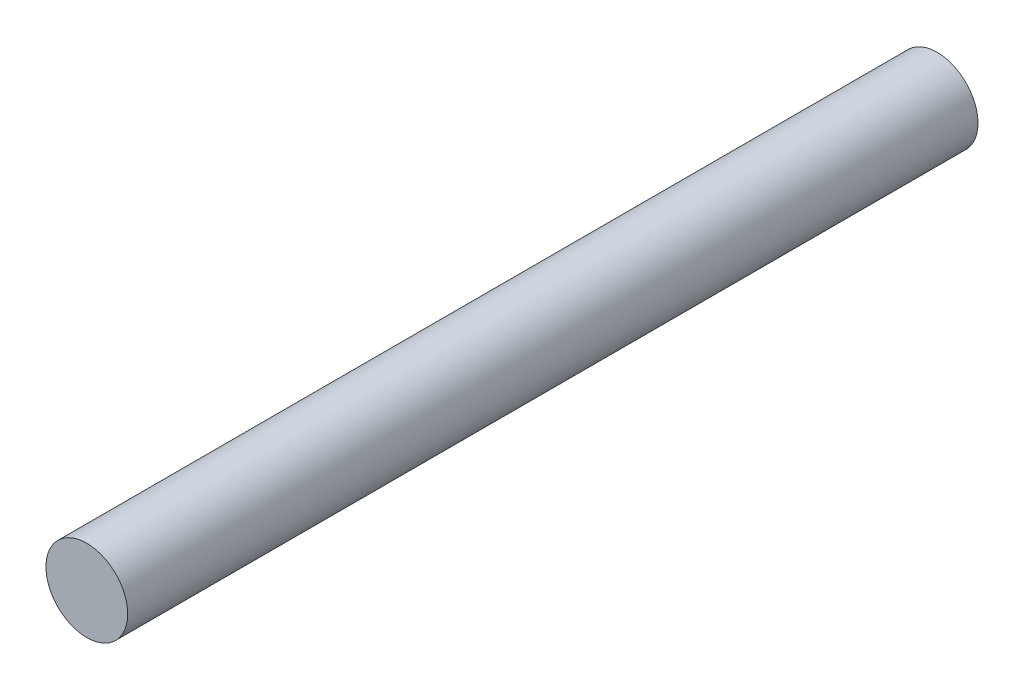
ISO-10303-21;
HEADER;
FILE_DESCRIPTION(('STEP AP214'),'2;1');
FILE_NAME('part.step','',(''),(''),'','','');
FILE_SCHEMA(('AUTOMOTIVE_DESIGN { 1 0 10303 214 1 1 1 1 }'));
ENDSEC;
DATA;
#1=APPLICATION_CONTEXT('core data for automotive mechanical design processes');
#2=APPLICATION_PROTOCOL_DEFINITION('international standard','automotive_design',2000,#1);
#3=PRODUCT_CONTEXT('',#1,'mechanical');
#4=PRODUCT('Part','Part','',(#3));
#5=PRODUCT_RELATED_PRODUCT_CATEGORY('part','',(#4));
#6=PRODUCT_DEFINITION_FORMATION('','',#4);
#7=PRODUCT_DEFINITION_CONTEXT('part definition',#1,'design');
#8=PRODUCT_DEFINITION('design','',#6,#7);
#9=PRODUCT_DEFINITION_SHAPE('','',#8);
#10=(LENGTH_UNIT() NAMED_UNIT(*) SI_UNIT(.MILLI.,.METRE.));
#11=(NAMED_UNIT(*) PLANE_ANGLE_UNIT() SI_UNIT($,.RADIAN.));
#12=(NAMED_UNIT(*) SI_UNIT($,.STERADIAN.) SOLID_ANGLE_UNIT());
#13=UNCERTAINTY_MEASURE_WITH_UNIT(LENGTH_MEASURE(1.E-05),#10,'distance_accuracy_value','');
#14=(GEOMETRIC_REPRESENTATION_CONTEXT(3) GLOBAL_UNCERTAINTY_ASSIGNED_CONTEXT((#13)) GLOBAL_UNIT_ASSIGNED_CONTEXT((#10,
#11,#12)) REPRESENTATION_CONTEXT('',''));
#15=CARTESIAN_POINT('',(0.,0.,0.));
#16=DIRECTION('',(0.,0.,1.));
#17=DIRECTION('',(1.,0.,0.));
#18=AXIS2_PLACEMENT_3D('',#15,#16,#17);
#19=CARTESIAN_POINT('',(0.,0.,127.198292242138));
#20=DIRECTION('',(0.,0.,-1.));
#21=DIRECTION('',(-1.,0.,0.));
#22=AXIS2_PLACEMENT_3D('',#19,#20,#21);
#23=CYLINDRICAL_SURFACE('',#22,6.35);
#24=CARTESIAN_POINT('',(0.,0.,-22.86));
#25=DIRECTION('',(0.,0.,1.));
#26=DIRECTION('',(1.,0.,0.));
#27=AXIS2_PLACEMENT_3D('',#24,#25,#26);
#28=CIRCLE('',#27,6.35);
#29=CARTESIAN_POINT('',(6.35,0.,-22.86));
#30=VERTEX_POINT('',#29);
#31=EDGE_CURVE('E51',#30,#30,#28,.T.);
#32=ORIENTED_EDGE('',*,*,#31,.T.);
#33=EDGE_LOOP('',(#32));
#34=FACE_BOUND('',#33,.T.);
#35=CARTESIAN_POINT('',(0.,0.,109.23778));
#36=DIRECTION('',(0.,0.,1.));
#37=DIRECTION('',(1.,0.,0.));
#38=AXIS2_PLACEMENT_3D('',#35,#36,#37);
#39=CIRCLE('',#38,6.35);
#40=CARTESIAN_POINT('',(6.35,0.,109.23778));
#41=VERTEX_POINT('',#40);
#42=EDGE_CURVE('E11',#41,#41,#39,.T.);
#43=ORIENTED_EDGE('',*,*,#42,.F.);
#44=EDGE_LOOP('',(#43));
#45=FACE_BOUND('',#44,.T.);
#46=ADVANCED_FACE('F44',(#34,#45),#23,.T.);
#47=CARTESIAN_POINT('',(0.,0.,-22.86));
#48=DIRECTION('',(0.,0.,1.));
#49=DIRECTION('',(1.,0.,0.));
#50=AXIS2_PLACEMENT_3D('',#47,#48,#49);
#51=PLANE('',#50);
#52=ORIENTED_EDGE('',*,*,#31,.F.);
#53=EDGE_LOOP('',(#52));
#54=FACE_BOUND('',#53,.T.);
#55=ADVANCED_FACE('F59',(#54),#51,.F.);
#56=CARTESIAN_POINT('',(0.,0.,109.23778));
#57=DIRECTION('',(0.,0.,1.));
#58=DIRECTION('',(1.,0.,0.));
#59=AXIS2_PLACEMENT_3D('',#56,#57,#58);
#60=PLANE('',#59);
#61=ORIENTED_EDGE('',*,*,#42,.T.);
#62=EDGE_LOOP('',(#61));
#63=FACE_BOUND('',#62,.T.);
#64=ADVANCED_FACE('F46',(#63),#60,.T.);
#65=CLOSED_SHELL('',(#46,#55,#64));
#66=MANIFOLD_SOLID_BREP('B2',#65);
#67=ADVANCED_BREP_SHAPE_REPRESENTATION('',(#18,#66),#14);
#68=SHAPE_DEFINITION_REPRESENTATION(#9,#67);
ENDSEC;
END-ISO-10303-21;
